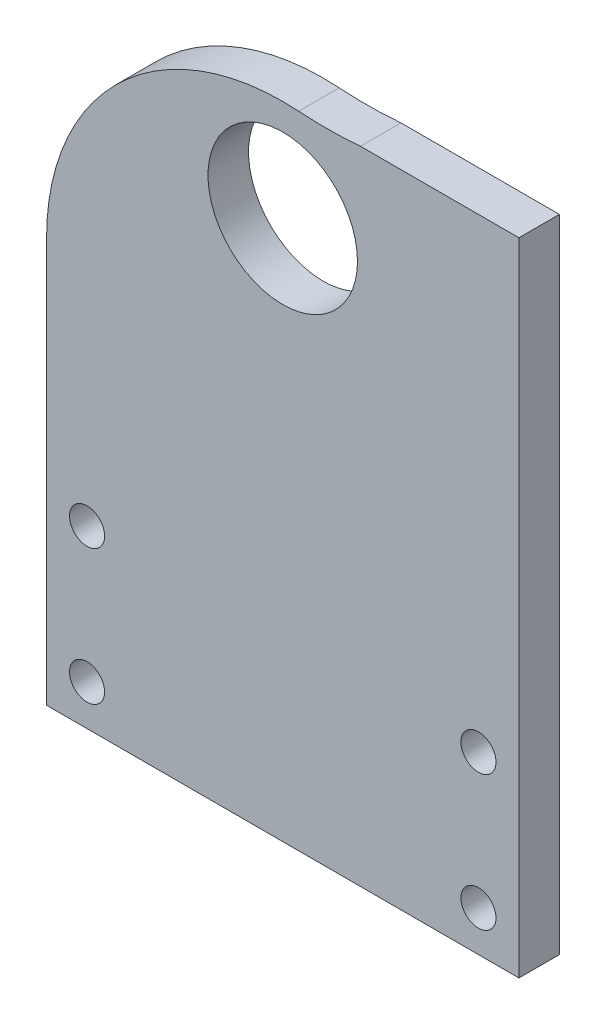
ISO-10303-21;
HEADER;
FILE_DESCRIPTION(('STEP AP214'),'2;1');
FILE_NAME('part.step','',(''),(''),'','','');
FILE_SCHEMA(('AUTOMOTIVE_DESIGN { 1 0 10303 214 1 1 1 1 }'));
ENDSEC;
DATA;
#1=APPLICATION_CONTEXT('core data for automotive mechanical design processes');
#2=APPLICATION_PROTOCOL_DEFINITION('international standard','automotive_design',2000,#1);
#3=PRODUCT_CONTEXT('',#1,'mechanical');
#4=PRODUCT('Part','Part','',(#3));
#5=PRODUCT_RELATED_PRODUCT_CATEGORY('part','',(#4));
#6=PRODUCT_DEFINITION_FORMATION('','',#4);
#7=PRODUCT_DEFINITION_CONTEXT('part definition',#1,'design');
#8=PRODUCT_DEFINITION('design','',#6,#7);
#9=PRODUCT_DEFINITION_SHAPE('','',#8);
#10=(LENGTH_UNIT() NAMED_UNIT(*) SI_UNIT(.MILLI.,.METRE.));
#11=(NAMED_UNIT(*) PLANE_ANGLE_UNIT() SI_UNIT($,.RADIAN.));
#12=(NAMED_UNIT(*) SI_UNIT($,.STERADIAN.) SOLID_ANGLE_UNIT());
#13=UNCERTAINTY_MEASURE_WITH_UNIT(LENGTH_MEASURE(1.E-05),#10,'distance_accuracy_value','');
#14=(GEOMETRIC_REPRESENTATION_CONTEXT(3) GLOBAL_UNCERTAINTY_ASSIGNED_CONTEXT((#13)) GLOBAL_UNIT_ASSIGNED_CONTEXT((#10,
#11,#12)) REPRESENTATION_CONTEXT('',''));
#15=CARTESIAN_POINT('',(0.,0.,0.));
#16=DIRECTION('',(0.,0.,1.));
#17=DIRECTION('',(1.,0.,0.));
#18=AXIS2_PLACEMENT_3D('',#15,#16,#17);
#19=CARTESIAN_POINT('',(-21.4103776781464,29.6521399019793,6.));
#20=DIRECTION('',(0.,0.,1.));
#21=DIRECTION('',(1.,0.,0.));
#22=AXIS2_PLACEMENT_3D('',#19,#20,#21);
#23=PLANE('',#22);
#24=DIRECTION('',(0.,1.,0.));
#25=VECTOR('',#24,1.);
#26=CARTESIAN_POINT('',(13.5896223218536,29.6521399019793,6.));
#27=LINE('',#26,#25);
#28=CARTESIAN_POINT('',(13.5896223218536,-30.3478600980205,6.));
#29=VERTEX_POINT('',#28);
#30=CARTESIAN_POINT('',(13.5896223218536,64.6521399019793,6.));
#31=VERTEX_POINT('',#30);
#32=EDGE_CURVE('E143',#29,#31,#27,.T.);
#33=ORIENTED_EDGE('',*,*,#32,.T.);
#34=DIRECTION('',(1.,0.,0.));
#35=VECTOR('',#34,1.);
#36=CARTESIAN_POINT('',(13.5896223218536,64.6521399019793,6.));
#37=LINE('',#36,#35);
#38=CARTESIAN_POINT('',(-9.89271758172387,64.6521399019793,6.));
#39=VERTEX_POINT('',#38);
#40=EDGE_CURVE('E104',#39,#31,#37,.T.);
#41=ORIENTED_EDGE('',*,*,#40,.F.);
#42=CARTESIAN_POINT('',(-14.99190246422,124.435066507609,6.));
#43=DIRECTION('',(0.,0.,1.));
#44=DIRECTION('',(1.,0.,0.));
#45=AXIS2_PLACEMENT_3D('',#42,#43,#44);
#46=CIRCLE('',#45,60.);
#47=CARTESIAN_POINT('',(-19.0456762835419,64.5721654935271,6.));
#48=VERTEX_POINT('',#47);
#49=EDGE_CURVE('E11',#39,#48,#46,.F.);
#50=ORIENTED_EDGE('',*,*,#49,.T.);
#51=CARTESIAN_POINT('',(-21.4103776781464,29.6521399019793,6.));
#52=DIRECTION('',(0.,0.,1.));
#53=DIRECTION('',(1.,0.,0.));
#54=AXIS2_PLACEMENT_3D('',#51,#52,#53);
#55=CIRCLE('',#54,35.);
#56=CARTESIAN_POINT('',(-56.4103776781464,29.6521399019793,6.));
#57=VERTEX_POINT('',#56);
#58=EDGE_CURVE('E145',#48,#57,#55,.T.);
#59=ORIENTED_EDGE('',*,*,#58,.T.);
#60=DIRECTION('',(0.,-1.,0.));
#61=VECTOR('',#60,1.);
#62=CARTESIAN_POINT('',(-56.4103776781464,29.6521399019793,6.));
#63=LINE('',#62,#61);
#64=CARTESIAN_POINT('',(-56.4103776781464,-30.3478600980205,6.));
#65=VERTEX_POINT('',#64);
#66=EDGE_CURVE('E148',#57,#65,#63,.T.);
#67=ORIENTED_EDGE('',*,*,#66,.T.);
#68=DIRECTION('',(1.,0.,0.));
#69=VECTOR('',#68,1.);
#70=CARTESIAN_POINT('',(-56.4103776781464,-30.3478600980205,6.));
#71=LINE('',#70,#69);
#72=EDGE_CURVE('E150',#65,#29,#71,.T.);
#73=ORIENTED_EDGE('',*,*,#72,.T.);
#74=EDGE_LOOP('',(#33,#41,#50,#59,#67,#73));
#75=FACE_BOUND('',#74,.T.);
#76=CARTESIAN_POINT('',(-50.4103776781465,-4.34786009802049,6.));
#77=DIRECTION('',(0.,0.,1.));
#78=DIRECTION('',(1.,0.,0.));
#79=AXIS2_PLACEMENT_3D('',#76,#77,#78);
#80=CIRCLE('',#79,2.6);
#81=CARTESIAN_POINT('',(-47.8103776781465,-4.34786009802049,6.));
#82=VERTEX_POINT('',#81);
#83=EDGE_CURVE('E121',#82,#82,#80,.T.);
#84=ORIENTED_EDGE('',*,*,#83,.F.);
#85=EDGE_LOOP('',(#84));
#86=FACE_BOUND('',#85,.T.);
#87=CARTESIAN_POINT('',(-50.4103776781464,-24.3478600980205,6.));
#88=DIRECTION('',(0.,0.,1.));
#89=DIRECTION('',(1.,0.,0.));
#90=AXIS2_PLACEMENT_3D('',#87,#88,#89);
#91=CIRCLE('',#90,2.6);
#92=CARTESIAN_POINT('',(-47.8103776781464,-24.3478600980205,6.));
#93=VERTEX_POINT('',#92);
#94=EDGE_CURVE('E133',#93,#93,#91,.T.);
#95=ORIENTED_EDGE('',*,*,#94,.F.);
#96=EDGE_LOOP('',(#95));
#97=FACE_BOUND('',#96,.T.);
#98=CARTESIAN_POINT('',(-21.4103776781464,49.6521399019795,6.));
#99=DIRECTION('',(0.,0.,1.));
#100=DIRECTION('',(1.,0.,0.));
#101=AXIS2_PLACEMENT_3D('',#98,#99,#100);
#102=CIRCLE('',#101,11.075);
#103=CARTESIAN_POINT('',(-10.3353776781464,49.6521399019795,6.));
#104=VERTEX_POINT('',#103);
#105=EDGE_CURVE('E97',#104,#104,#102,.T.);
#106=ORIENTED_EDGE('',*,*,#105,.F.);
#107=EDGE_LOOP('',(#106));
#108=FACE_BOUND('',#107,.T.);
#109=CARTESIAN_POINT('',(7.58962232185361,-24.3478600980205,6.));
#110=DIRECTION('',(0.,0.,1.));
#111=DIRECTION('',(1.,0.,0.));
#112=AXIS2_PLACEMENT_3D('',#109,#110,#111);
#113=CIRCLE('',#112,2.6);
#114=CARTESIAN_POINT('',(10.1896223218536,-24.3478600980205,6.));
#115=VERTEX_POINT('',#114);
#116=EDGE_CURVE('E127',#115,#115,#113,.T.);
#117=ORIENTED_EDGE('',*,*,#116,.F.);
#118=EDGE_LOOP('',(#117));
#119=FACE_BOUND('',#118,.T.);
#120=CARTESIAN_POINT('',(7.58962232185354,-4.34786009802049,6.));
#121=DIRECTION('',(0.,0.,1.));
#122=DIRECTION('',(1.,0.,0.));
#123=AXIS2_PLACEMENT_3D('',#120,#121,#122);
#124=CIRCLE('',#123,2.6);
#125=CARTESIAN_POINT('',(10.1896223218535,-4.34786009802049,6.));
#126=VERTEX_POINT('',#125);
#127=EDGE_CURVE('E115',#126,#126,#124,.T.);
#128=ORIENTED_EDGE('',*,*,#127,.F.);
#129=EDGE_LOOP('',(#128));
#130=FACE_BOUND('',#129,.T.);
#131=ADVANCED_FACE('F33',(#75,#86,#97,#108,#119,#130),#23,.T.);
#132=CARTESIAN_POINT('',(-21.4103776781464,29.6521399019793,0.));
#133=DIRECTION('',(0.,0.,1.));
#134=DIRECTION('',(1.,0.,0.));
#135=AXIS2_PLACEMENT_3D('',#132,#133,#134);
#136=PLANE('',#135);
#137=DIRECTION('',(1.,0.,0.));
#138=VECTOR('',#137,1.);
#139=CARTESIAN_POINT('',(13.5896223218536,64.6521399019793,0.));
#140=LINE('',#139,#138);
#141=CARTESIAN_POINT('',(-9.89271758172387,64.6521399019793,0.));
#142=VERTEX_POINT('',#141);
#143=CARTESIAN_POINT('',(13.5896223218536,64.6521399019793,0.));
#144=VERTEX_POINT('',#143);
#145=EDGE_CURVE('E103',#142,#144,#140,.T.);
#146=ORIENTED_EDGE('',*,*,#145,.T.);
#147=DIRECTION('',(0.,1.,0.));
#148=VECTOR('',#147,1.);
#149=CARTESIAN_POINT('',(13.5896223218536,29.6521399019793,0.));
#150=LINE('',#149,#148);
#151=CARTESIAN_POINT('',(13.5896223218536,-30.3478600980205,0.));
#152=VERTEX_POINT('',#151);
#153=EDGE_CURVE('E85',#152,#144,#150,.T.);
#154=ORIENTED_EDGE('',*,*,#153,.F.);
#155=DIRECTION('',(1.,0.,0.));
#156=VECTOR('',#155,1.);
#157=CARTESIAN_POINT('',(-56.4103776781464,-30.3478600980205,0.));
#158=LINE('',#157,#156);
#159=CARTESIAN_POINT('',(-56.4103776781464,-30.3478600980205,0.));
#160=VERTEX_POINT('',#159);
#161=EDGE_CURVE('E146',#160,#152,#158,.T.);
#162=ORIENTED_EDGE('',*,*,#161,.F.);
#163=DIRECTION('',(0.,-1.,0.));
#164=VECTOR('',#163,1.);
#165=CARTESIAN_POINT('',(-56.4103776781464,29.6521399019793,0.));
#166=LINE('',#165,#164);
#167=CARTESIAN_POINT('',(-56.4103776781464,29.6521399019793,0.));
#168=VERTEX_POINT('',#167);
#169=EDGE_CURVE('E153',#168,#160,#166,.T.);
#170=ORIENTED_EDGE('',*,*,#169,.F.);
#171=CARTESIAN_POINT('',(-21.4103776781464,29.6521399019793,0.));
#172=DIRECTION('',(0.,0.,1.));
#173=DIRECTION('',(1.,0.,0.));
#174=AXIS2_PLACEMENT_3D('',#171,#172,#173);
#175=CIRCLE('',#174,35.);
#176=CARTESIAN_POINT('',(-19.0456762835419,64.5721654935271,0.));
#177=VERTEX_POINT('',#176);
#178=EDGE_CURVE('E96',#177,#168,#175,.T.);
#179=ORIENTED_EDGE('',*,*,#178,.F.);
#180=CARTESIAN_POINT('',(-14.99190246422,124.435066507609,0.));
#181=DIRECTION('',(0.,0.,1.));
#182=DIRECTION('',(1.,0.,0.));
#183=AXIS2_PLACEMENT_3D('',#180,#181,#182);
#184=CIRCLE('',#183,60.);
#185=EDGE_CURVE('E41',#177,#142,#184,.T.);
#186=ORIENTED_EDGE('',*,*,#185,.T.);
#187=EDGE_LOOP('',(#146,#154,#162,#170,#179,#186));
#188=FACE_BOUND('',#187,.T.);
#189=CARTESIAN_POINT('',(7.58962232185354,-4.34786009802049,0.));
#190=DIRECTION('',(0.,0.,1.));
#191=DIRECTION('',(1.,0.,0.));
#192=AXIS2_PLACEMENT_3D('',#189,#190,#191);
#193=CIRCLE('',#192,2.6);
#194=CARTESIAN_POINT('',(10.1896223218535,-4.34786009802049,0.));
#195=VERTEX_POINT('',#194);
#196=EDGE_CURVE('E105',#195,#195,#193,.T.);
#197=ORIENTED_EDGE('',*,*,#196,.T.);
#198=EDGE_LOOP('',(#197));
#199=FACE_BOUND('',#198,.T.);
#200=CARTESIAN_POINT('',(-50.4103776781465,-4.34786009802049,0.));
#201=DIRECTION('',(0.,0.,1.));
#202=DIRECTION('',(1.,0.,0.));
#203=AXIS2_PLACEMENT_3D('',#200,#201,#202);
#204=CIRCLE('',#203,2.6);
#205=CARTESIAN_POINT('',(-47.8103776781465,-4.34786009802049,0.));
#206=VERTEX_POINT('',#205);
#207=EDGE_CURVE('E118',#206,#206,#204,.T.);
#208=ORIENTED_EDGE('',*,*,#207,.T.);
#209=EDGE_LOOP('',(#208));
#210=FACE_BOUND('',#209,.T.);
#211=CARTESIAN_POINT('',(7.58962232185361,-24.3478600980205,0.));
#212=DIRECTION('',(0.,0.,1.));
#213=DIRECTION('',(1.,0.,0.));
#214=AXIS2_PLACEMENT_3D('',#211,#212,#213);
#215=CIRCLE('',#214,2.6);
#216=CARTESIAN_POINT('',(10.1896223218536,-24.3478600980205,0.));
#217=VERTEX_POINT('',#216);
#218=EDGE_CURVE('E124',#217,#217,#215,.T.);
#219=ORIENTED_EDGE('',*,*,#218,.T.);
#220=EDGE_LOOP('',(#219));
#221=FACE_BOUND('',#220,.T.);
#222=CARTESIAN_POINT('',(-50.4103776781464,-24.3478600980205,0.));
#223=DIRECTION('',(0.,0.,1.));
#224=DIRECTION('',(1.,0.,0.));
#225=AXIS2_PLACEMENT_3D('',#222,#223,#224);
#226=CIRCLE('',#225,2.6);
#227=CARTESIAN_POINT('',(-47.8103776781464,-24.3478600980205,0.));
#228=VERTEX_POINT('',#227);
#229=EDGE_CURVE('E130',#228,#228,#226,.T.);
#230=ORIENTED_EDGE('',*,*,#229,.T.);
#231=EDGE_LOOP('',(#230));
#232=FACE_BOUND('',#231,.T.);
#233=CARTESIAN_POINT('',(-21.4103776781464,49.6521399019795,0.));
#234=DIRECTION('',(0.,0.,1.));
#235=DIRECTION('',(1.,0.,0.));
#236=AXIS2_PLACEMENT_3D('',#233,#234,#235);
#237=CIRCLE('',#236,11.075);
#238=CARTESIAN_POINT('',(-10.3353776781464,49.6521399019795,0.));
#239=VERTEX_POINT('',#238);
#240=EDGE_CURVE('E136',#239,#239,#237,.T.);
#241=ORIENTED_EDGE('',*,*,#240,.T.);
#242=EDGE_LOOP('',(#241));
#243=FACE_BOUND('',#242,.T.);
#244=ADVANCED_FACE('F107',(#188,#199,#210,#221,#232,#243),#136,.F.);
#245=CARTESIAN_POINT('',(13.5896223218536,29.6521399019793,6.));
#246=DIRECTION('',(-1.,0.,0.));
#247=DIRECTION('',(0.,-1.,0.));
#248=AXIS2_PLACEMENT_3D('',#245,#246,#247);
#249=PLANE('',#248);
#250=ORIENTED_EDGE('',*,*,#153,.T.);
#251=DIRECTION('',(0.,0.,-1.));
#252=VECTOR('',#251,1.);
#253=CARTESIAN_POINT('',(13.5896223218536,64.6521399019793,48.1476012051358));
#254=LINE('',#253,#252);
#255=EDGE_CURVE('E89',#31,#144,#254,.T.);
#256=ORIENTED_EDGE('',*,*,#255,.F.);
#257=ORIENTED_EDGE('',*,*,#32,.F.);
#258=DIRECTION('',(0.,0.,-1.));
#259=VECTOR('',#258,1.);
#260=CARTESIAN_POINT('',(13.5896223218536,-30.3478600980205,6.));
#261=LINE('',#260,#259);
#262=EDGE_CURVE('E92',#29,#152,#261,.T.);
#263=ORIENTED_EDGE('',*,*,#262,.T.);
#264=EDGE_LOOP('',(#250,#256,#257,#263));
#265=FACE_BOUND('',#264,.T.);
#266=ADVANCED_FACE('F87',(#265),#249,.F.);
#267=CARTESIAN_POINT('',(-21.4103776781464,29.6521399019793,6.));
#268=DIRECTION('',(0.,0.,-1.));
#269=DIRECTION('',(-1.,0.,0.));
#270=AXIS2_PLACEMENT_3D('',#267,#268,#269);
#271=CYLINDRICAL_SURFACE('',#270,35.);
#272=ORIENTED_EDGE('',*,*,#58,.F.);
#273=DIRECTION('',(0.,0.,-1.));
#274=VECTOR('',#273,1.);
#275=CARTESIAN_POINT('',(-19.0456762835419,64.5721654935271,6.));
#276=LINE('',#275,#274);
#277=EDGE_CURVE('E163',#48,#177,#276,.T.);
#278=ORIENTED_EDGE('',*,*,#277,.T.);
#279=ORIENTED_EDGE('',*,*,#178,.T.);
#280=DIRECTION('',(0.,0.,-1.));
#281=VECTOR('',#280,1.);
#282=CARTESIAN_POINT('',(-56.4103776781464,29.6521399019793,6.));
#283=LINE('',#282,#281);
#284=EDGE_CURVE('E160',#57,#168,#283,.T.);
#285=ORIENTED_EDGE('',*,*,#284,.F.);
#286=EDGE_LOOP('',(#272,#278,#279,#285));
#287=FACE_BOUND('',#286,.T.);
#288=ADVANCED_FACE('F165',(#287),#271,.T.);
#289=CARTESIAN_POINT('',(-56.4103776781464,29.6521399019793,6.));
#290=DIRECTION('',(1.,0.,0.));
#291=DIRECTION('',(0.,0.,-1.));
#292=AXIS2_PLACEMENT_3D('',#289,#290,#291);
#293=PLANE('',#292);
#294=ORIENTED_EDGE('',*,*,#169,.T.);
#295=DIRECTION('',(0.,0.,-1.));
#296=VECTOR('',#295,1.);
#297=CARTESIAN_POINT('',(-56.4103776781464,-30.3478600980205,6.));
#298=LINE('',#297,#296);
#299=EDGE_CURVE('E157',#65,#160,#298,.T.);
#300=ORIENTED_EDGE('',*,*,#299,.F.);
#301=ORIENTED_EDGE('',*,*,#66,.F.);
#302=ORIENTED_EDGE('',*,*,#284,.T.);
#303=EDGE_LOOP('',(#294,#300,#301,#302));
#304=FACE_BOUND('',#303,.T.);
#305=ADVANCED_FACE('F170',(#304),#293,.F.);
#306=CARTESIAN_POINT('',(-56.4103776781464,-30.3478600980205,6.));
#307=DIRECTION('',(0.,1.,0.));
#308=DIRECTION('',(-1.,0.,0.));
#309=AXIS2_PLACEMENT_3D('',#306,#307,#308);
#310=PLANE('',#309);
#311=ORIENTED_EDGE('',*,*,#161,.T.);
#312=ORIENTED_EDGE('',*,*,#262,.F.);
#313=ORIENTED_EDGE('',*,*,#72,.F.);
#314=ORIENTED_EDGE('',*,*,#299,.T.);
#315=EDGE_LOOP('',(#311,#312,#313,#314));
#316=FACE_BOUND('',#315,.T.);
#317=ADVANCED_FACE('F174',(#316),#310,.F.);
#318=CARTESIAN_POINT('',(-21.4103776781464,49.6521399019795,6.));
#319=DIRECTION('',(0.,0.,-1.));
#320=DIRECTION('',(-1.,0.,0.));
#321=AXIS2_PLACEMENT_3D('',#318,#319,#320);
#322=CYLINDRICAL_SURFACE('',#321,11.075);
#323=ORIENTED_EDGE('',*,*,#105,.T.);
#324=EDGE_LOOP('',(#323));
#325=FACE_BOUND('',#324,.T.);
#326=ORIENTED_EDGE('',*,*,#240,.F.);
#327=EDGE_LOOP('',(#326));
#328=FACE_BOUND('',#327,.T.);
#329=ADVANCED_FACE('F190',(#325,#328),#322,.F.);
#330=CARTESIAN_POINT('',(-50.4103776781464,-24.3478600980205,6.));
#331=DIRECTION('',(0.,0.,-1.));
#332=DIRECTION('',(-1.,0.,0.));
#333=AXIS2_PLACEMENT_3D('',#330,#331,#332);
#334=CYLINDRICAL_SURFACE('',#333,2.6);
#335=ORIENTED_EDGE('',*,*,#94,.T.);
#336=EDGE_LOOP('',(#335));
#337=FACE_BOUND('',#336,.T.);
#338=ORIENTED_EDGE('',*,*,#229,.F.);
#339=EDGE_LOOP('',(#338));
#340=FACE_BOUND('',#339,.T.);
#341=ADVANCED_FACE('F264',(#337,#340),#334,.F.);
#342=CARTESIAN_POINT('',(7.58962232185361,-24.3478600980205,6.));
#343=DIRECTION('',(0.,0.,-1.));
#344=DIRECTION('',(-1.,0.,0.));
#345=AXIS2_PLACEMENT_3D('',#342,#343,#344);
#346=CYLINDRICAL_SURFACE('',#345,2.6);
#347=ORIENTED_EDGE('',*,*,#116,.T.);
#348=EDGE_LOOP('',(#347));
#349=FACE_BOUND('',#348,.T.);
#350=ORIENTED_EDGE('',*,*,#218,.F.);
#351=EDGE_LOOP('',(#350));
#352=FACE_BOUND('',#351,.T.);
#353=ADVANCED_FACE('F272',(#349,#352),#346,.F.);
#354=CARTESIAN_POINT('',(-50.4103776781465,-4.34786009802049,6.));
#355=DIRECTION('',(0.,0.,-1.));
#356=DIRECTION('',(-1.,0.,0.));
#357=AXIS2_PLACEMENT_3D('',#354,#355,#356);
#358=CYLINDRICAL_SURFACE('',#357,2.6);
#359=ORIENTED_EDGE('',*,*,#83,.T.);
#360=EDGE_LOOP('',(#359));
#361=FACE_BOUND('',#360,.T.);
#362=ORIENTED_EDGE('',*,*,#207,.F.);
#363=EDGE_LOOP('',(#362));
#364=FACE_BOUND('',#363,.T.);
#365=ADVANCED_FACE('F280',(#361,#364),#358,.F.);
#366=CARTESIAN_POINT('',(7.58962232185354,-4.34786009802049,6.));
#367=DIRECTION('',(0.,0.,-1.));
#368=DIRECTION('',(-1.,0.,0.));
#369=AXIS2_PLACEMENT_3D('',#366,#367,#368);
#370=CYLINDRICAL_SURFACE('',#369,2.6);
#371=ORIENTED_EDGE('',*,*,#127,.T.);
#372=EDGE_LOOP('',(#371));
#373=FACE_BOUND('',#372,.T.);
#374=ORIENTED_EDGE('',*,*,#196,.F.);
#375=EDGE_LOOP('',(#374));
#376=FACE_BOUND('',#375,.T.);
#377=ADVANCED_FACE('F180',(#373,#376),#370,.F.);
#378=CARTESIAN_POINT('',(13.5896223218536,64.6521399019793,48.1476012051358));
#379=DIRECTION('',(0.,1.,0.));
#380=DIRECTION('',(0.,0.,1.));
#381=AXIS2_PLACEMENT_3D('',#378,#379,#380);
#382=PLANE('',#381);
#383=DIRECTION('',(0.,0.,-1.));
#384=VECTOR('',#383,1.);
#385=CARTESIAN_POINT('',(-9.89271758172387,64.6521399019793,48.1476012051358));
#386=LINE('',#385,#384);
#387=EDGE_CURVE('E110',#39,#142,#386,.T.);
#388=ORIENTED_EDGE('',*,*,#387,.F.);
#389=ORIENTED_EDGE('',*,*,#40,.T.);
#390=ORIENTED_EDGE('',*,*,#255,.T.);
#391=ORIENTED_EDGE('',*,*,#145,.F.);
#392=EDGE_LOOP('',(#388,#389,#390,#391));
#393=FACE_BOUND('',#392,.T.);
#394=ADVANCED_FACE('F102',(#393),#382,.T.);
#395=CARTESIAN_POINT('',(-14.99190246422,124.435066507609,48.1476012051358));
#396=DIRECTION('',(0.,0.,1.));
#397=DIRECTION('',(1.,0.,0.));
#398=AXIS2_PLACEMENT_3D('',#395,#396,#397);
#399=CYLINDRICAL_SURFACE('',#398,60.);
#400=ORIENTED_EDGE('',*,*,#49,.F.);
#401=ORIENTED_EDGE('',*,*,#387,.T.);
#402=ORIENTED_EDGE('',*,*,#185,.F.);
#403=ORIENTED_EDGE('',*,*,#277,.F.);
#404=EDGE_LOOP('',(#400,#401,#402,#403));
#405=FACE_BOUND('',#404,.T.);
#406=ADVANCED_FACE('F35',(#405),#399,.F.);
#407=CLOSED_SHELL('',(#131,#244,#266,#288,#305,#317,#329,#341,#353,#365,#377,#394,#406));
#408=MANIFOLD_SOLID_BREP('B2',#407);
#409=ADVANCED_BREP_SHAPE_REPRESENTATION('',(#18,#408),#14);
#410=SHAPE_DEFINITION_REPRESENTATION(#9,#409);
ENDSEC;
END-ISO-10303-21;
